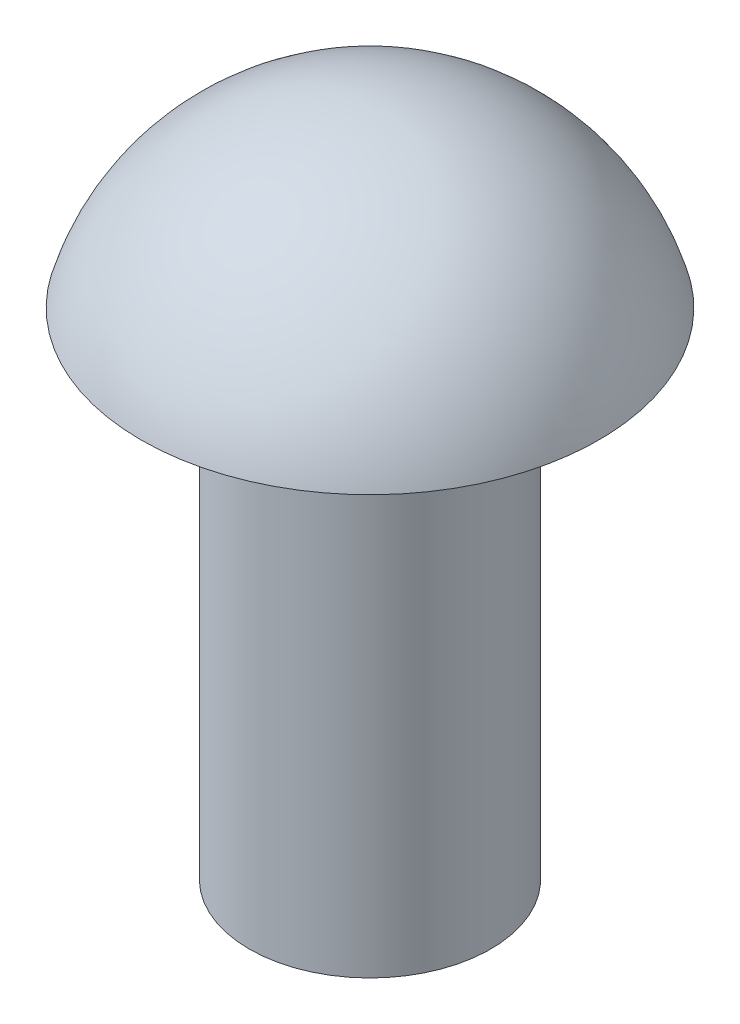
ISO-10303-21;
HEADER;
FILE_DESCRIPTION(('STEP AP214'),'2;1');
FILE_NAME('part.step','',(''),(''),'','','');
FILE_SCHEMA(('AUTOMOTIVE_DESIGN { 1 0 10303 214 1 1 1 1 }'));
ENDSEC;
DATA;
#1=APPLICATION_CONTEXT('core data for automotive mechanical design processes');
#2=APPLICATION_PROTOCOL_DEFINITION('international standard','automotive_design',2000,#1);
#3=PRODUCT_CONTEXT('',#1,'mechanical');
#4=PRODUCT('Part','Part','',(#3));
#5=PRODUCT_RELATED_PRODUCT_CATEGORY('part','',(#4));
#6=PRODUCT_DEFINITION_FORMATION('','',#4);
#7=PRODUCT_DEFINITION_CONTEXT('part definition',#1,'design');
#8=PRODUCT_DEFINITION('design','',#6,#7);
#9=PRODUCT_DEFINITION_SHAPE('','',#8);
#10=(LENGTH_UNIT() NAMED_UNIT(*) SI_UNIT(.MILLI.,.METRE.));
#11=(NAMED_UNIT(*) PLANE_ANGLE_UNIT() SI_UNIT($,.RADIAN.));
#12=(NAMED_UNIT(*) SI_UNIT($,.STERADIAN.) SOLID_ANGLE_UNIT());
#13=UNCERTAINTY_MEASURE_WITH_UNIT(LENGTH_MEASURE(1.E-05),#10,'distance_accuracy_value','');
#14=(GEOMETRIC_REPRESENTATION_CONTEXT(3) GLOBAL_UNCERTAINTY_ASSIGNED_CONTEXT((#13)) GLOBAL_UNIT_ASSIGNED_CONTEXT((#10,
#11,#12)) REPRESENTATION_CONTEXT('',''));
#15=CARTESIAN_POINT('',(0.,0.,0.));
#16=DIRECTION('',(0.,0.,1.));
#17=DIRECTION('',(1.,0.,0.));
#18=AXIS2_PLACEMENT_3D('',#15,#16,#17);
#19=CARTESIAN_POINT('',(0.,-1.92232142857143,0.));
#20=DIRECTION('',(0.,1.,0.));
#21=DIRECTION('',(0.,0.,-1.));
#22=AXIS2_PLACEMENT_3D('',#19,#20,#21);
#23=SPHERICAL_SURFACE('',#22,1.92232142857143);
#24=CARTESIAN_POINT('',(0.,-1.4,0.));
#25=DIRECTION('',(0.,1.,0.));
#26=DIRECTION('',(0.,0.,1.));
#27=AXIS2_PLACEMENT_3D('',#24,#25,#26);
#28=CIRCLE('',#27,1.85);
#29=CARTESIAN_POINT('',(0.,-1.4,1.85));
#30=VERTEX_POINT('',#29);
#31=EDGE_CURVE('E47',#30,#30,#28,.T.);
#32=ORIENTED_EDGE('',*,*,#31,.T.);
#33=EDGE_LOOP('',(#32));
#34=FACE_BOUND('',#33,.T.);
#35=ADVANCED_FACE('F37',(#34),#23,.T.);
#36=CARTESIAN_POINT('',(0.,-5.4,0.));
#37=DIRECTION('',(0.,1.,0.));
#38=DIRECTION('',(0.,0.,1.));
#39=AXIS2_PLACEMENT_3D('',#36,#37,#38);
#40=PLANE('',#39);
#41=CARTESIAN_POINT('',(0.,-5.4,0.));
#42=DIRECTION('',(0.,1.,0.));
#43=DIRECTION('',(0.,0.,1.));
#44=AXIS2_PLACEMENT_3D('',#41,#42,#43);
#45=CIRCLE('',#44,0.975000000000001);
#46=CARTESIAN_POINT('',(0.,-5.4,0.975000000000001));
#47=VERTEX_POINT('',#46);
#48=EDGE_CURVE('E10',#47,#47,#45,.T.);
#49=ORIENTED_EDGE('',*,*,#48,.F.);
#50=EDGE_LOOP('',(#49));
#51=FACE_BOUND('',#50,.T.);
#52=ADVANCED_FACE('F62',(#51),#40,.F.);
#53=CARTESIAN_POINT('',(0.,0.,0.));
#54=DIRECTION('',(0.,1.,0.));
#55=DIRECTION('',(0.,0.,1.));
#56=AXIS2_PLACEMENT_3D('',#53,#54,#55);
#57=CYLINDRICAL_SURFACE('',#56,0.975000000000001);
#58=CARTESIAN_POINT('',(0.,-1.4,0.));
#59=DIRECTION('',(0.,1.,0.));
#60=DIRECTION('',(0.,0.,1.));
#61=AXIS2_PLACEMENT_3D('',#58,#59,#60);
#62=CIRCLE('',#61,0.975000000000001);
#63=CARTESIAN_POINT('',(0.,-1.4,0.975000000000001));
#64=VERTEX_POINT('',#63);
#65=EDGE_CURVE('E43',#64,#64,#62,.T.);
#66=ORIENTED_EDGE('',*,*,#65,.F.);
#67=EDGE_LOOP('',(#66));
#68=FACE_BOUND('',#67,.T.);
#69=ORIENTED_EDGE('',*,*,#48,.T.);
#70=EDGE_LOOP('',(#69));
#71=FACE_BOUND('',#70,.T.);
#72=ADVANCED_FACE('F57',(#68,#71),#57,.T.);
#73=CARTESIAN_POINT('',(0.,-1.4,-0.975000000000001));
#74=DIRECTION('',(0.,1.,0.));
#75=DIRECTION('',(0.,0.,1.));
#76=AXIS2_PLACEMENT_3D('',#73,#74,#75);
#77=PLANE('',#76);
#78=ORIENTED_EDGE('',*,*,#31,.F.);
#79=EDGE_LOOP('',(#78));
#80=FACE_BOUND('',#79,.T.);
#81=ORIENTED_EDGE('',*,*,#65,.T.);
#82=EDGE_LOOP('',(#81));
#83=FACE_BOUND('',#82,.T.);
#84=ADVANCED_FACE('F55',(#80,#83),#77,.F.);
#85=CLOSED_SHELL('',(#35,#52,#72,#84));
#86=MANIFOLD_SOLID_BREP('B2',#85);
#87=ADVANCED_BREP_SHAPE_REPRESENTATION('',(#18,#86),#14);
#88=SHAPE_DEFINITION_REPRESENTATION(#9,#87);
ENDSEC;
END-ISO-10303-21;
